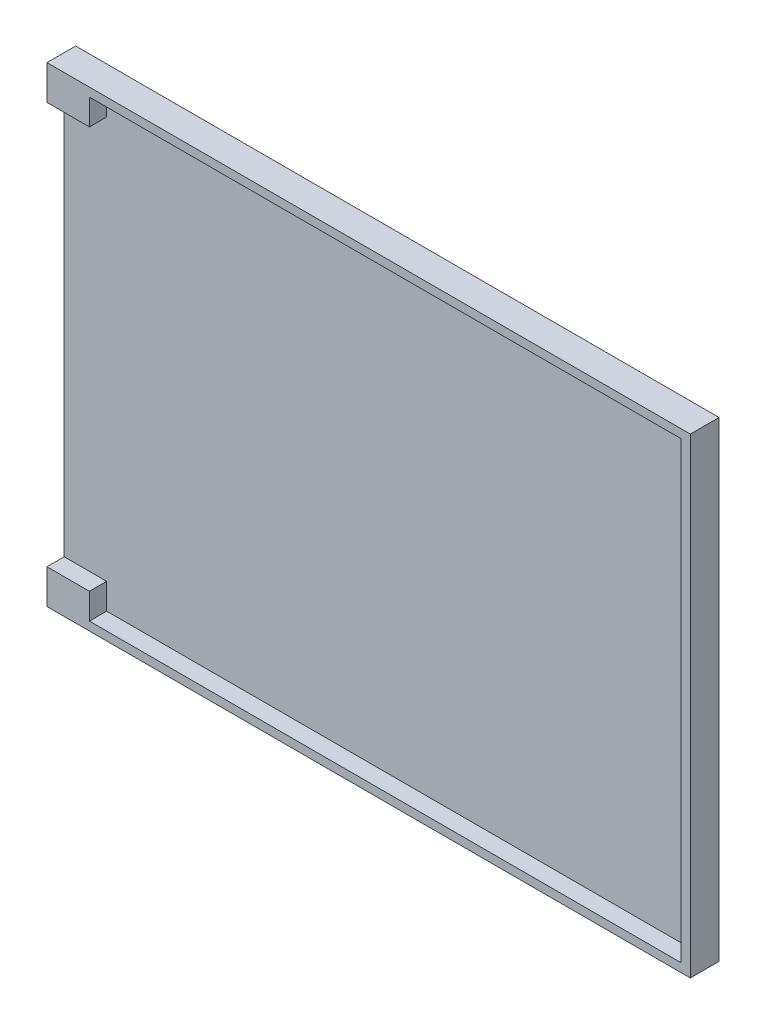
ISO-10303-21;
HEADER;
FILE_DESCRIPTION(('STEP AP214'),'2;1');
FILE_NAME('part.step','',(''),(''),'','','');
FILE_SCHEMA(('AUTOMOTIVE_DESIGN { 1 0 10303 214 1 1 1 1 }'));
ENDSEC;
DATA;
#1=APPLICATION_CONTEXT('core data for automotive mechanical design processes');
#2=APPLICATION_PROTOCOL_DEFINITION('international standard','automotive_design',2000,#1);
#3=PRODUCT_CONTEXT('',#1,'mechanical');
#4=PRODUCT('Part','Part','',(#3));
#5=PRODUCT_RELATED_PRODUCT_CATEGORY('part','',(#4));
#6=PRODUCT_DEFINITION_FORMATION('','',#4);
#7=PRODUCT_DEFINITION_CONTEXT('part definition',#1,'design');
#8=PRODUCT_DEFINITION('design','',#6,#7);
#9=PRODUCT_DEFINITION_SHAPE('','',#8);
#10=(LENGTH_UNIT() NAMED_UNIT(*) SI_UNIT(.MILLI.,.METRE.));
#11=(NAMED_UNIT(*) PLANE_ANGLE_UNIT() SI_UNIT($,.RADIAN.));
#12=(NAMED_UNIT(*) SI_UNIT($,.STERADIAN.) SOLID_ANGLE_UNIT());
#13=UNCERTAINTY_MEASURE_WITH_UNIT(LENGTH_MEASURE(1.E-05),#10,'distance_accuracy_value','');
#14=(GEOMETRIC_REPRESENTATION_CONTEXT(3) GLOBAL_UNCERTAINTY_ASSIGNED_CONTEXT((#13)) GLOBAL_UNIT_ASSIGNED_CONTEXT((#10,
#11,#12)) REPRESENTATION_CONTEXT('',''));
#15=CARTESIAN_POINT('',(0.,0.,0.));
#16=DIRECTION('',(0.,0.,1.));
#17=DIRECTION('',(1.,0.,0.));
#18=AXIS2_PLACEMENT_3D('',#15,#16,#17);
#19=CARTESIAN_POINT('',(-24.1541861464034,9.8458485840136,1.));
#20=DIRECTION('',(-1.,0.,0.));
#21=DIRECTION('',(0.,0.,1.));
#22=AXIS2_PLACEMENT_3D('',#19,#20,#21);
#23=PLANE('',#22);
#24=DIRECTION('',(0.,-1.,0.));
#25=VECTOR('',#24,1.);
#26=CARTESIAN_POINT('',(-24.1541861464034,9.8458485840136,2.5));
#27=LINE('',#26,#25);
#28=CARTESIAN_POINT('',(-24.1541861464034,9.8458485840136,2.5));
#29=VERTEX_POINT('',#28);
#30=CARTESIAN_POINT('',(-24.1541861464034,7.5958485840136,2.5));
#31=VERTEX_POINT('',#30);
#32=EDGE_CURVE('E164',#29,#31,#27,.T.);
#33=ORIENTED_EDGE('',*,*,#32,.T.);
#34=DIRECTION('',(0.,0.,1.));
#35=VECTOR('',#34,1.);
#36=CARTESIAN_POINT('',(-24.1541861464034,7.5958485840136,1.));
#37=LINE('',#36,#35);
#38=CARTESIAN_POINT('',(-24.1541861464034,7.5958485840136,1.));
#39=VERTEX_POINT('',#38);
#40=EDGE_CURVE('E146',#39,#31,#37,.T.);
#41=ORIENTED_EDGE('',*,*,#40,.F.);
#42=DIRECTION('',(0.,-1.,0.));
#43=VECTOR('',#42,1.);
#44=CARTESIAN_POINT('',(-24.1541861464034,9.8458485840136,1.));
#45=LINE('',#44,#43);
#46=CARTESIAN_POINT('',(-24.1541861464034,9.8458485840136,1.));
#47=VERTEX_POINT('',#46);
#48=EDGE_CURVE('E151',#47,#39,#45,.T.);
#49=ORIENTED_EDGE('',*,*,#48,.F.);
#50=DIRECTION('',(0.,0.,1.));
#51=VECTOR('',#50,1.);
#52=CARTESIAN_POINT('',(-24.1541861464034,9.8458485840136,1.));
#53=LINE('',#52,#51);
#54=EDGE_CURVE('E176',#47,#29,#53,.T.);
#55=ORIENTED_EDGE('',*,*,#54,.T.);
#56=EDGE_LOOP('',(#33,#41,#49,#55));
#57=FACE_BOUND('',#56,.T.);
#58=ADVANCED_FACE('F35',(#57),#23,.F.);
#59=CARTESIAN_POINT('',(28.1458138535966,10.5958485840136,2.5));
#60=DIRECTION('',(-1.,0.,0.));
#61=DIRECTION('',(0.,-1.,0.));
#62=AXIS2_PLACEMENT_3D('',#59,#60,#61);
#63=PLANE('',#62);
#64=DIRECTION('',(0.,1.,0.));
#65=VECTOR('',#64,1.);
#66=CARTESIAN_POINT('',(28.1458138535966,10.5958485840136,0.));
#67=LINE('',#66,#65);
#68=CARTESIAN_POINT('',(28.1458138535966,-30.4041514159864,0.));
#69=VERTEX_POINT('',#68);
#70=CARTESIAN_POINT('',(28.1458138535966,10.5958485840136,0.));
#71=VERTEX_POINT('',#70);
#72=EDGE_CURVE('E178',#69,#71,#67,.T.);
#73=ORIENTED_EDGE('',*,*,#72,.T.);
#74=DIRECTION('',(0.,0.,-1.));
#75=VECTOR('',#74,1.);
#76=CARTESIAN_POINT('',(28.1458138535966,10.5958485840136,2.5));
#77=LINE('',#76,#75);
#78=CARTESIAN_POINT('',(28.1458138535966,10.5958485840136,2.5));
#79=VERTEX_POINT('',#78);
#80=EDGE_CURVE('E11',#79,#71,#77,.T.);
#81=ORIENTED_EDGE('',*,*,#80,.F.);
#82=DIRECTION('',(0.,1.,0.));
#83=VECTOR('',#82,1.);
#84=CARTESIAN_POINT('',(28.1458138535966,10.5958485840136,2.5));
#85=LINE('',#84,#83);
#86=CARTESIAN_POINT('',(28.1458138535966,-30.4041514159864,2.5));
#87=VERTEX_POINT('',#86);
#88=EDGE_CURVE('E184',#87,#79,#85,.T.);
#89=ORIENTED_EDGE('',*,*,#88,.F.);
#90=DIRECTION('',(0.,0.,-1.));
#91=VECTOR('',#90,1.);
#92=CARTESIAN_POINT('',(28.1458138535966,-30.4041514159864,2.5));
#93=LINE('',#92,#91);
#94=EDGE_CURVE('E195',#87,#69,#93,.T.);
#95=ORIENTED_EDGE('',*,*,#94,.T.);
#96=EDGE_LOOP('',(#73,#81,#89,#95));
#97=FACE_BOUND('',#96,.T.);
#98=ADVANCED_FACE('F37',(#97),#63,.F.);
#99=CARTESIAN_POINT('',(-27.8541861464034,10.5958485840136,2.5));
#100=DIRECTION('',(0.,-1.,0.));
#101=DIRECTION('',(0.,0.,-1.));
#102=AXIS2_PLACEMENT_3D('',#99,#100,#101);
#103=PLANE('',#102);
#104=DIRECTION('',(-1.,0.,0.));
#105=VECTOR('',#104,1.);
#106=CARTESIAN_POINT('',(-27.8541861464034,10.5958485840136,0.));
#107=LINE('',#106,#105);
#108=CARTESIAN_POINT('',(-27.8541861464034,10.5958485840136,0.));
#109=VERTEX_POINT('',#108);
#110=EDGE_CURVE('E198',#71,#109,#107,.T.);
#111=ORIENTED_EDGE('',*,*,#110,.T.);
#112=DIRECTION('',(0.,0.,-1.));
#113=VECTOR('',#112,1.);
#114=CARTESIAN_POINT('',(-27.8541861464034,10.5958485840136,2.5));
#115=LINE('',#114,#113);
#116=CARTESIAN_POINT('',(-27.8541861464034,10.5958485840136,2.5));
#117=VERTEX_POINT('',#116);
#118=EDGE_CURVE('E43',#117,#109,#115,.T.);
#119=ORIENTED_EDGE('',*,*,#118,.F.);
#120=DIRECTION('',(-1.,0.,0.));
#121=VECTOR('',#120,1.);
#122=CARTESIAN_POINT('',(-27.8541861464034,10.5958485840136,2.5));
#123=LINE('',#122,#121);
#124=EDGE_CURVE('E187',#79,#117,#123,.T.);
#125=ORIENTED_EDGE('',*,*,#124,.F.);
#126=ORIENTED_EDGE('',*,*,#80,.T.);
#127=EDGE_LOOP('',(#111,#119,#125,#126));
#128=FACE_BOUND('',#127,.T.);
#129=ADVANCED_FACE('F264',(#128),#103,.F.);
#130=CARTESIAN_POINT('',(-27.8541861464034,10.5958485840136,2.5));
#131=DIRECTION('',(1.,0.,0.));
#132=DIRECTION('',(0.,1.,0.));
#133=AXIS2_PLACEMENT_3D('',#130,#131,#132);
#134=PLANE('',#133);
#135=DIRECTION('',(0.,-1.,0.));
#136=VECTOR('',#135,1.);
#137=CARTESIAN_POINT('',(-27.8541861464034,7.5958485840136,1.));
#138=LINE('',#137,#136);
#139=CARTESIAN_POINT('',(-27.8541861464034,7.5958485840136,1.));
#140=VERTEX_POINT('',#139);
#141=CARTESIAN_POINT('',(-27.8541861464034,-27.4041514159864,1.));
#142=VERTEX_POINT('',#141);
#143=EDGE_CURVE('E131',#140,#142,#138,.T.);
#144=ORIENTED_EDGE('',*,*,#143,.F.);
#145=DIRECTION('',(0.,0.,1.));
#146=VECTOR('',#145,1.);
#147=CARTESIAN_POINT('',(-27.8541861464034,7.5958485840136,1.));
#148=LINE('',#147,#146);
#149=CARTESIAN_POINT('',(-27.8541861464034,7.5958485840136,2.5));
#150=VERTEX_POINT('',#149);
#151=EDGE_CURVE('E231',#140,#150,#148,.T.);
#152=ORIENTED_EDGE('',*,*,#151,.T.);
#153=DIRECTION('',(0.,-1.,0.));
#154=VECTOR('',#153,1.);
#155=CARTESIAN_POINT('',(-27.8541861464034,10.5958485840136,2.5));
#156=LINE('',#155,#154);
#157=EDGE_CURVE('E190',#117,#150,#156,.T.);
#158=ORIENTED_EDGE('',*,*,#157,.F.);
#159=ORIENTED_EDGE('',*,*,#118,.T.);
#160=DIRECTION('',(0.,-1.,0.));
#161=VECTOR('',#160,1.);
#162=CARTESIAN_POINT('',(-27.8541861464034,10.5958485840136,0.));
#163=LINE('',#162,#161);
#164=CARTESIAN_POINT('',(-27.8541861464034,-30.4041514159864,0.));
#165=VERTEX_POINT('',#164);
#166=EDGE_CURVE('E200',#109,#165,#163,.T.);
#167=ORIENTED_EDGE('',*,*,#166,.T.);
#168=DIRECTION('',(0.,0.,-1.));
#169=VECTOR('',#168,1.);
#170=CARTESIAN_POINT('',(-27.8541861464034,-30.4041514159864,2.5));
#171=LINE('',#170,#169);
#172=CARTESIAN_POINT('',(-27.8541861464034,-30.4041514159864,2.5));
#173=VERTEX_POINT('',#172);
#174=EDGE_CURVE('E205',#173,#165,#171,.T.);
#175=ORIENTED_EDGE('',*,*,#174,.F.);
#176=CARTESIAN_POINT('',(-27.8541861464034,-27.4041514159864,2.5));
#177=VERTEX_POINT('',#176);
#178=EDGE_CURVE('E144',#177,#173,#156,.T.);
#179=ORIENTED_EDGE('',*,*,#178,.F.);
#180=DIRECTION('',(0.,0.,1.));
#181=VECTOR('',#180,1.);
#182=CARTESIAN_POINT('',(-27.8541861464034,-27.4041514159864,1.));
#183=LINE('',#182,#181);
#184=EDGE_CURVE('E126',#142,#177,#183,.T.);
#185=ORIENTED_EDGE('',*,*,#184,.F.);
#186=EDGE_LOOP('',(#144,#152,#158,#159,#167,#175,#179,#185));
#187=FACE_BOUND('',#186,.T.);
#188=ADVANCED_FACE('F142',(#187),#134,.F.);
#189=CARTESIAN_POINT('',(-27.8541861464034,-30.4041514159864,2.5));
#190=DIRECTION('',(0.,1.,0.));
#191=DIRECTION('',(0.,0.,1.));
#192=AXIS2_PLACEMENT_3D('',#189,#190,#191);
#193=PLANE('',#192);
#194=DIRECTION('',(1.,0.,0.));
#195=VECTOR('',#194,1.);
#196=CARTESIAN_POINT('',(-27.8541861464034,-30.4041514159864,0.));
#197=LINE('',#196,#195);
#198=EDGE_CURVE('E188',#165,#69,#197,.T.);
#199=ORIENTED_EDGE('',*,*,#198,.T.);
#200=ORIENTED_EDGE('',*,*,#94,.F.);
#201=DIRECTION('',(1.,0.,0.));
#202=VECTOR('',#201,1.);
#203=CARTESIAN_POINT('',(-27.8541861464034,-30.4041514159864,2.5));
#204=LINE('',#203,#202);
#205=EDGE_CURVE('E193',#173,#87,#204,.T.);
#206=ORIENTED_EDGE('',*,*,#205,.F.);
#207=ORIENTED_EDGE('',*,*,#174,.T.);
#208=EDGE_LOOP('',(#199,#200,#206,#207));
#209=FACE_BOUND('',#208,.T.);
#210=ADVANCED_FACE('F218',(#209),#193,.F.);
#211=CARTESIAN_POINT('',(0.,0.,2.5));
#212=DIRECTION('',(0.,0.,1.));
#213=DIRECTION('',(1.,0.,0.));
#214=AXIS2_PLACEMENT_3D('',#211,#212,#213);
#215=PLANE('',#214);
#216=DIRECTION('',(-1.,0.,0.));
#217=VECTOR('',#216,1.);
#218=CARTESIAN_POINT('',(-27.8541861464034,7.5958485840136,2.5));
#219=LINE('',#218,#217);
#220=EDGE_CURVE('E139',#31,#150,#219,.T.);
#221=ORIENTED_EDGE('',*,*,#220,.F.);
#222=ORIENTED_EDGE('',*,*,#32,.F.);
#223=DIRECTION('',(-1.,0.,0.));
#224=VECTOR('',#223,1.);
#225=CARTESIAN_POINT('',(-24.1541861464034,9.8458485840136,2.5));
#226=LINE('',#225,#224);
#227=CARTESIAN_POINT('',(27.3458138535966,9.8458485840136,2.5));
#228=VERTEX_POINT('',#227);
#229=EDGE_CURVE('E173',#228,#29,#226,.T.);
#230=ORIENTED_EDGE('',*,*,#229,.F.);
#231=DIRECTION('',(0.,1.,0.));
#232=VECTOR('',#231,1.);
#233=CARTESIAN_POINT('',(27.3458138535966,9.8458485840136,2.5));
#234=LINE('',#233,#232);
#235=CARTESIAN_POINT('',(27.3458138535966,-29.6541514159864,2.5));
#236=VERTEX_POINT('',#235);
#237=EDGE_CURVE('E170',#236,#228,#234,.T.);
#238=ORIENTED_EDGE('',*,*,#237,.F.);
#239=DIRECTION('',(1.,0.,0.));
#240=VECTOR('',#239,1.);
#241=CARTESIAN_POINT('',(-24.1541861464034,-29.6541514159864,2.5));
#242=LINE('',#241,#240);
#243=CARTESIAN_POINT('',(-24.1541861464034,-29.6541514159864,2.5));
#244=VERTEX_POINT('',#243);
#245=EDGE_CURVE('E167',#244,#236,#242,.T.);
#246=ORIENTED_EDGE('',*,*,#245,.F.);
#247=CARTESIAN_POINT('',(-24.1541861464034,-27.4041514159864,2.5));
#248=VERTEX_POINT('',#247);
#249=EDGE_CURVE('E58',#248,#244,#27,.T.);
#250=ORIENTED_EDGE('',*,*,#249,.F.);
#251=DIRECTION('',(1.,0.,0.));
#252=VECTOR('',#251,1.);
#253=CARTESIAN_POINT('',(-27.8541861464034,-27.4041514159864,2.5));
#254=LINE('',#253,#252);
#255=EDGE_CURVE('E226',#177,#248,#254,.T.);
#256=ORIENTED_EDGE('',*,*,#255,.F.);
#257=ORIENTED_EDGE('',*,*,#178,.T.);
#258=ORIENTED_EDGE('',*,*,#205,.T.);
#259=ORIENTED_EDGE('',*,*,#88,.T.);
#260=ORIENTED_EDGE('',*,*,#124,.T.);
#261=ORIENTED_EDGE('',*,*,#157,.T.);
#262=EDGE_LOOP('',(#221,#222,#230,#238,#246,#250,#256,#257,#258,#259,#260,#261));
#263=FACE_BOUND('',#262,.T.);
#264=ADVANCED_FACE('F225',(#263),#215,.T.);
#265=CARTESIAN_POINT('',(0.,0.,0.));
#266=DIRECTION('',(0.,0.,1.));
#267=DIRECTION('',(1.,0.,0.));
#268=AXIS2_PLACEMENT_3D('',#265,#266,#267);
#269=PLANE('',#268);
#270=ORIENTED_EDGE('',*,*,#72,.F.);
#271=ORIENTED_EDGE('',*,*,#198,.F.);
#272=ORIENTED_EDGE('',*,*,#166,.F.);
#273=ORIENTED_EDGE('',*,*,#110,.F.);
#274=EDGE_LOOP('',(#270,#271,#272,#273));
#275=FACE_BOUND('',#274,.T.);
#276=ADVANCED_FACE('F215',(#275),#269,.F.);
#277=CARTESIAN_POINT('',(-24.1541861464034,-27.4041514159864,1.));
#278=VERTEX_POINT('',#277);
#279=CARTESIAN_POINT('',(-24.1541861464034,-29.6541514159864,1.));
#280=VERTEX_POINT('',#279);
#281=EDGE_CURVE('E154',#278,#280,#45,.T.);
#282=ORIENTED_EDGE('',*,*,#281,.F.);
#283=DIRECTION('',(0.,0.,1.));
#284=VECTOR('',#283,1.);
#285=CARTESIAN_POINT('',(-24.1541861464034,-27.4041514159864,1.));
#286=LINE('',#285,#284);
#287=EDGE_CURVE('E128',#278,#248,#286,.T.);
#288=ORIENTED_EDGE('',*,*,#287,.T.);
#289=ORIENTED_EDGE('',*,*,#249,.T.);
#290=DIRECTION('',(0.,0.,1.));
#291=VECTOR('',#290,1.);
#292=CARTESIAN_POINT('',(-24.1541861464034,-29.6541514159864,1.));
#293=LINE('',#292,#291);
#294=EDGE_CURVE('E163',#280,#244,#293,.T.);
#295=ORIENTED_EDGE('',*,*,#294,.F.);
#296=EDGE_LOOP('',(#282,#288,#289,#295));
#297=FACE_BOUND('',#296,.T.);
#298=ADVANCED_FACE('F249',(#297),#23,.F.);
#299=CARTESIAN_POINT('',(-24.1541861464034,9.8458485840136,1.));
#300=DIRECTION('',(0.,1.,0.));
#301=DIRECTION('',(0.,0.,1.));
#302=AXIS2_PLACEMENT_3D('',#299,#300,#301);
#303=PLANE('',#302);
#304=ORIENTED_EDGE('',*,*,#229,.T.);
#305=ORIENTED_EDGE('',*,*,#54,.F.);
#306=DIRECTION('',(-1.,0.,0.));
#307=VECTOR('',#306,1.);
#308=CARTESIAN_POINT('',(-24.1541861464034,9.8458485840136,1.));
#309=LINE('',#308,#307);
#310=CARTESIAN_POINT('',(27.3458138535966,9.8458485840136,1.));
#311=VERTEX_POINT('',#310);
#312=EDGE_CURVE('E160',#311,#47,#309,.T.);
#313=ORIENTED_EDGE('',*,*,#312,.F.);
#314=DIRECTION('',(0.,0.,1.));
#315=VECTOR('',#314,1.);
#316=CARTESIAN_POINT('',(27.3458138535966,9.8458485840136,1.));
#317=LINE('',#316,#315);
#318=EDGE_CURVE('E179',#311,#228,#317,.T.);
#319=ORIENTED_EDGE('',*,*,#318,.T.);
#320=EDGE_LOOP('',(#304,#305,#313,#319));
#321=FACE_BOUND('',#320,.T.);
#322=ADVANCED_FACE('F241',(#321),#303,.F.);
#323=CARTESIAN_POINT('',(27.3458138535966,9.8458485840136,1.));
#324=DIRECTION('',(1.,0.,0.));
#325=DIRECTION('',(0.,0.,-1.));
#326=AXIS2_PLACEMENT_3D('',#323,#324,#325);
#327=PLANE('',#326);
#328=ORIENTED_EDGE('',*,*,#237,.T.);
#329=ORIENTED_EDGE('',*,*,#318,.F.);
#330=DIRECTION('',(0.,1.,0.));
#331=VECTOR('',#330,1.);
#332=CARTESIAN_POINT('',(27.3458138535966,9.8458485840136,1.));
#333=LINE('',#332,#331);
#334=CARTESIAN_POINT('',(27.3458138535966,-29.6541514159864,1.));
#335=VERTEX_POINT('',#334);
#336=EDGE_CURVE('E157',#335,#311,#333,.T.);
#337=ORIENTED_EDGE('',*,*,#336,.F.);
#338=DIRECTION('',(0.,0.,1.));
#339=VECTOR('',#338,1.);
#340=CARTESIAN_POINT('',(27.3458138535966,-29.6541514159864,1.));
#341=LINE('',#340,#339);
#342=EDGE_CURVE('E181',#335,#236,#341,.T.);
#343=ORIENTED_EDGE('',*,*,#342,.T.);
#344=EDGE_LOOP('',(#328,#329,#337,#343));
#345=FACE_BOUND('',#344,.T.);
#346=ADVANCED_FACE('F244',(#345),#327,.F.);
#347=CARTESIAN_POINT('',(-24.1541861464034,-29.6541514159864,1.));
#348=DIRECTION('',(0.,-1.,0.));
#349=DIRECTION('',(0.,0.,-1.));
#350=AXIS2_PLACEMENT_3D('',#347,#348,#349);
#351=PLANE('',#350);
#352=ORIENTED_EDGE('',*,*,#245,.T.);
#353=ORIENTED_EDGE('',*,*,#342,.F.);
#354=DIRECTION('',(1.,0.,0.));
#355=VECTOR('',#354,1.);
#356=CARTESIAN_POINT('',(-24.1541861464034,-29.6541514159864,1.));
#357=LINE('',#356,#355);
#358=EDGE_CURVE('E153',#280,#335,#357,.T.);
#359=ORIENTED_EDGE('',*,*,#358,.F.);
#360=ORIENTED_EDGE('',*,*,#294,.T.);
#361=EDGE_LOOP('',(#352,#353,#359,#360));
#362=FACE_BOUND('',#361,.T.);
#363=ADVANCED_FACE('F248',(#362),#351,.F.);
#364=CARTESIAN_POINT('',(0.,0.,1.));
#365=DIRECTION('',(0.,0.,1.));
#366=DIRECTION('',(1.,0.,0.));
#367=AXIS2_PLACEMENT_3D('',#364,#365,#366);
#368=PLANE('',#367);
#369=ORIENTED_EDGE('',*,*,#48,.T.);
#370=DIRECTION('',(-1.,0.,0.));
#371=VECTOR('',#370,1.);
#372=CARTESIAN_POINT('',(-27.8541861464034,7.5958485840136,1.));
#373=LINE('',#372,#371);
#374=EDGE_CURVE('E130',#39,#140,#373,.T.);
#375=ORIENTED_EDGE('',*,*,#374,.T.);
#376=ORIENTED_EDGE('',*,*,#143,.T.);
#377=DIRECTION('',(1.,0.,0.));
#378=VECTOR('',#377,1.);
#379=CARTESIAN_POINT('',(-27.8541861464034,-27.4041514159864,1.));
#380=LINE('',#379,#378);
#381=EDGE_CURVE('E50',#142,#278,#380,.T.);
#382=ORIENTED_EDGE('',*,*,#381,.T.);
#383=ORIENTED_EDGE('',*,*,#281,.T.);
#384=ORIENTED_EDGE('',*,*,#358,.T.);
#385=ORIENTED_EDGE('',*,*,#336,.T.);
#386=ORIENTED_EDGE('',*,*,#312,.T.);
#387=EDGE_LOOP('',(#369,#375,#376,#382,#383,#384,#385,#386));
#388=FACE_BOUND('',#387,.T.);
#389=ADVANCED_FACE('F136',(#388),#368,.T.);
#390=CARTESIAN_POINT('',(-27.8541861464034,7.5958485840136,1.));
#391=DIRECTION('',(0.,1.,0.));
#392=DIRECTION('',(0.,0.,1.));
#393=AXIS2_PLACEMENT_3D('',#390,#391,#392);
#394=PLANE('',#393);
#395=ORIENTED_EDGE('',*,*,#220,.T.);
#396=ORIENTED_EDGE('',*,*,#151,.F.);
#397=ORIENTED_EDGE('',*,*,#374,.F.);
#398=ORIENTED_EDGE('',*,*,#40,.T.);
#399=EDGE_LOOP('',(#395,#396,#397,#398));
#400=FACE_BOUND('',#399,.T.);
#401=ADVANCED_FACE('F234',(#400),#394,.F.);
#402=CARTESIAN_POINT('',(-27.8541861464034,-27.4041514159864,1.));
#403=DIRECTION('',(0.,-1.,0.));
#404=DIRECTION('',(0.,0.,-1.));
#405=AXIS2_PLACEMENT_3D('',#402,#403,#404);
#406=PLANE('',#405);
#407=ORIENTED_EDGE('',*,*,#255,.T.);
#408=ORIENTED_EDGE('',*,*,#287,.F.);
#409=ORIENTED_EDGE('',*,*,#381,.F.);
#410=ORIENTED_EDGE('',*,*,#184,.T.);
#411=EDGE_LOOP('',(#407,#408,#409,#410));
#412=FACE_BOUND('',#411,.T.);
#413=ADVANCED_FACE('F124',(#412),#406,.F.);
#414=CLOSED_SHELL('',(#58,#98,#129,#188,#210,#264,#276,#298,#322,#346,#363,#389,#401,#413));
#415=MANIFOLD_SOLID_BREP('B2',#414);
#416=ADVANCED_BREP_SHAPE_REPRESENTATION('',(#18,#415),#14);
#417=SHAPE_DEFINITION_REPRESENTATION(#9,#416);
ENDSEC;
END-ISO-10303-21;
